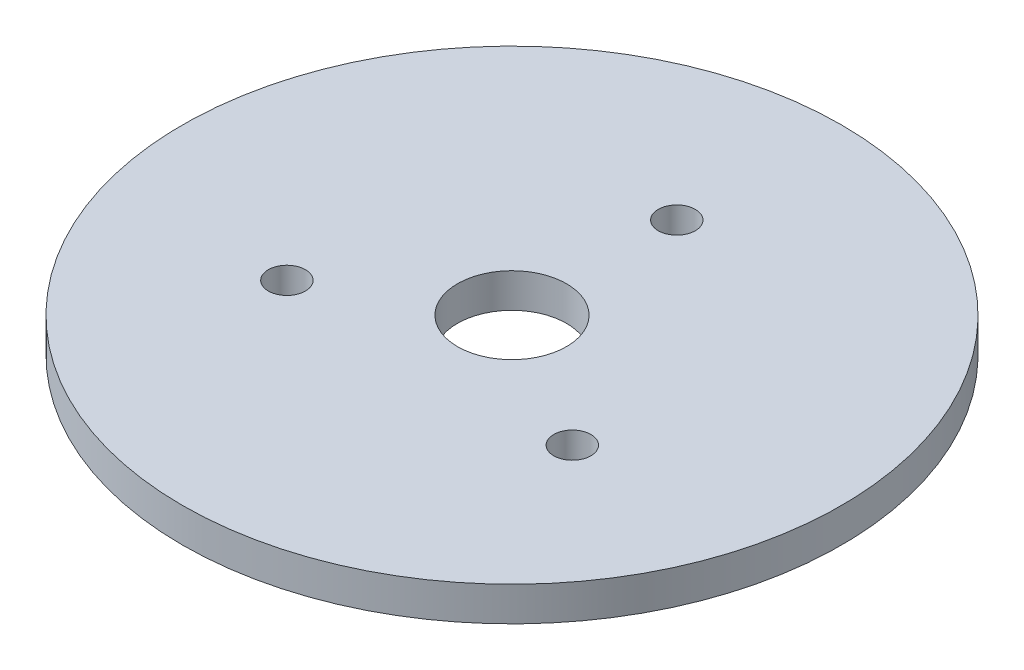
ISO-10303-21;
HEADER;
FILE_DESCRIPTION(('STEP AP214'),'2;1');
FILE_NAME('part.step','',(''),(''),'','','');
FILE_SCHEMA(('AUTOMOTIVE_DESIGN { 1 0 10303 214 1 1 1 1 }'));
ENDSEC;
DATA;
#1=APPLICATION_CONTEXT('core data for automotive mechanical design processes');
#2=APPLICATION_PROTOCOL_DEFINITION('international standard','automotive_design',2000,#1);
#3=PRODUCT_CONTEXT('',#1,'mechanical');
#4=PRODUCT('Part','Part','',(#3));
#5=PRODUCT_RELATED_PRODUCT_CATEGORY('part','',(#4));
#6=PRODUCT_DEFINITION_FORMATION('','',#4);
#7=PRODUCT_DEFINITION_CONTEXT('part definition',#1,'design');
#8=PRODUCT_DEFINITION('design','',#6,#7);
#9=PRODUCT_DEFINITION_SHAPE('','',#8);
#10=(LENGTH_UNIT() NAMED_UNIT(*) SI_UNIT(.MILLI.,.METRE.));
#11=(NAMED_UNIT(*) PLANE_ANGLE_UNIT() SI_UNIT($,.RADIAN.));
#12=(NAMED_UNIT(*) SI_UNIT($,.STERADIAN.) SOLID_ANGLE_UNIT());
#13=UNCERTAINTY_MEASURE_WITH_UNIT(LENGTH_MEASURE(1.E-05),#10,'distance_accuracy_value','');
#14=(GEOMETRIC_REPRESENTATION_CONTEXT(3) GLOBAL_UNCERTAINTY_ASSIGNED_CONTEXT((#13)) GLOBAL_UNIT_ASSIGNED_CONTEXT((#10,
#11,#12)) REPRESENTATION_CONTEXT('',''));
#15=CARTESIAN_POINT('',(0.,0.,0.));
#16=DIRECTION('',(0.,0.,1.));
#17=DIRECTION('',(1.,0.,0.));
#18=AXIS2_PLACEMENT_3D('',#15,#16,#17);
#19=CARTESIAN_POINT('',(0.,2.5,0.));
#20=DIRECTION('',(0.,1.,0.));
#21=DIRECTION('',(0.,0.,1.));
#22=AXIS2_PLACEMENT_3D('',#19,#20,#21);
#23=PLANE('',#22);
#24=CARTESIAN_POINT('',(0.,2.5,0.));
#25=DIRECTION('',(0.,1.,0.));
#26=DIRECTION('',(0.,0.,1.));
#27=AXIS2_PLACEMENT_3D('',#24,#25,#26);
#28=CIRCLE('',#27,3.96875);
#29=CARTESIAN_POINT('',(0.,2.5,3.96875));
#30=VERTEX_POINT('',#29);
#31=EDGE_CURVE('E65',#30,#30,#28,.T.);
#32=ORIENTED_EDGE('',*,*,#31,.F.);
#33=EDGE_LOOP('',(#32));
#34=FACE_BOUND('',#33,.T.);
#35=CARTESIAN_POINT('',(10.389135192436,2.5,5.99816999999967));
#36=DIRECTION('',(0.,1.,0.));
#37=DIRECTION('',(0.,0.,1.));
#38=AXIS2_PLACEMENT_3D('',#35,#36,#37);
#39=CIRCLE('',#38,1.35);
#40=CARTESIAN_POINT('',(10.389135192436,2.5,7.34816999999966));
#41=VERTEX_POINT('',#40);
#42=EDGE_CURVE('E50',#41,#41,#39,.T.);
#43=ORIENTED_EDGE('',*,*,#42,.F.);
#44=EDGE_LOOP('',(#43));
#45=FACE_BOUND('',#44,.T.);
#46=CARTESIAN_POINT('',(0.,2.5,0.));
#47=DIRECTION('',(0.,1.,0.));
#48=DIRECTION('',(0.,0.,1.));
#49=AXIS2_PLACEMENT_3D('',#46,#47,#48);
#50=CIRCLE('',#49,23.99268);
#51=CARTESIAN_POINT('',(0.,2.5,23.99268));
#52=VERTEX_POINT('',#51);
#53=EDGE_CURVE('E10',#52,#52,#50,.T.);
#54=ORIENTED_EDGE('',*,*,#53,.T.);
#55=EDGE_LOOP('',(#54));
#56=FACE_BOUND('',#55,.T.);
#57=CARTESIAN_POINT('',(0.,2.5,-11.99634));
#58=DIRECTION('',(0.,1.,0.));
#59=DIRECTION('',(0.,0.,1.));
#60=AXIS2_PLACEMENT_3D('',#57,#58,#59);
#61=CIRCLE('',#60,1.35);
#62=CARTESIAN_POINT('',(0.,2.5,-10.64634));
#63=VERTEX_POINT('',#62);
#64=EDGE_CURVE('E45',#63,#63,#61,.T.);
#65=ORIENTED_EDGE('',*,*,#64,.F.);
#66=EDGE_LOOP('',(#65));
#67=FACE_BOUND('',#66,.T.);
#68=CARTESIAN_POINT('',(-10.3891351924348,2.5,5.99817000000034));
#69=DIRECTION('',(0.,1.,0.));
#70=DIRECTION('',(0.,0.,1.));
#71=AXIS2_PLACEMENT_3D('',#68,#69,#70);
#72=CIRCLE('',#71,1.35);
#73=CARTESIAN_POINT('',(-10.3891351924348,2.5,7.34817000000034));
#74=VERTEX_POINT('',#73);
#75=EDGE_CURVE('E56',#74,#74,#72,.T.);
#76=ORIENTED_EDGE('',*,*,#75,.F.);
#77=EDGE_LOOP('',(#76));
#78=FACE_BOUND('',#77,.T.);
#79=ADVANCED_FACE('F34',(#34,#45,#56,#67,#78),#23,.T.);
#80=CARTESIAN_POINT('',(0.,0.,0.));
#81=DIRECTION('',(0.,1.,0.));
#82=DIRECTION('',(0.,0.,1.));
#83=AXIS2_PLACEMENT_3D('',#80,#81,#82);
#84=PLANE('',#83);
#85=CARTESIAN_POINT('',(0.,0.,0.));
#86=DIRECTION('',(0.,1.,0.));
#87=DIRECTION('',(0.,0.,1.));
#88=AXIS2_PLACEMENT_3D('',#85,#86,#87);
#89=CIRCLE('',#88,3.96875);
#90=CARTESIAN_POINT('',(0.,0.,3.96875));
#91=VERTEX_POINT('',#90);
#92=EDGE_CURVE('E62',#91,#91,#89,.T.);
#93=ORIENTED_EDGE('',*,*,#92,.T.);
#94=EDGE_LOOP('',(#93));
#95=FACE_BOUND('',#94,.T.);
#96=CARTESIAN_POINT('',(0.,0.,0.));
#97=DIRECTION('',(0.,1.,0.));
#98=DIRECTION('',(0.,0.,1.));
#99=AXIS2_PLACEMENT_3D('',#96,#97,#98);
#100=CIRCLE('',#99,23.99268);
#101=CARTESIAN_POINT('',(0.,0.,23.99268));
#102=VERTEX_POINT('',#101);
#103=EDGE_CURVE('E38',#102,#102,#100,.T.);
#104=ORIENTED_EDGE('',*,*,#103,.F.);
#105=EDGE_LOOP('',(#104));
#106=FACE_BOUND('',#105,.T.);
#107=CARTESIAN_POINT('',(0.,0.,-11.99634));
#108=DIRECTION('',(0.,1.,0.));
#109=DIRECTION('',(0.,0.,1.));
#110=AXIS2_PLACEMENT_3D('',#107,#108,#109);
#111=CIRCLE('',#110,1.35);
#112=CARTESIAN_POINT('',(0.,0.,-10.64634));
#113=VERTEX_POINT('',#112);
#114=EDGE_CURVE('E47',#113,#113,#111,.T.);
#115=ORIENTED_EDGE('',*,*,#114,.T.);
#116=EDGE_LOOP('',(#115));
#117=FACE_BOUND('',#116,.T.);
#118=CARTESIAN_POINT('',(10.389135192436,0.,5.99816999999967));
#119=DIRECTION('',(0.,1.,0.));
#120=DIRECTION('',(0.,0.,1.));
#121=AXIS2_PLACEMENT_3D('',#118,#119,#120);
#122=CIRCLE('',#121,1.35);
#123=CARTESIAN_POINT('',(10.389135192436,0.,7.34816999999966));
#124=VERTEX_POINT('',#123);
#125=EDGE_CURVE('E53',#124,#124,#122,.T.);
#126=ORIENTED_EDGE('',*,*,#125,.T.);
#127=EDGE_LOOP('',(#126));
#128=FACE_BOUND('',#127,.T.);
#129=CARTESIAN_POINT('',(-10.3891351924348,0.,5.99817000000034));
#130=DIRECTION('',(0.,1.,0.));
#131=DIRECTION('',(0.,0.,1.));
#132=AXIS2_PLACEMENT_3D('',#129,#130,#131);
#133=CIRCLE('',#132,1.35);
#134=CARTESIAN_POINT('',(-10.3891351924348,0.,7.34817000000034));
#135=VERTEX_POINT('',#134);
#136=EDGE_CURVE('E59',#135,#135,#133,.T.);
#137=ORIENTED_EDGE('',*,*,#136,.T.);
#138=EDGE_LOOP('',(#137));
#139=FACE_BOUND('',#138,.T.);
#140=ADVANCED_FACE('F71',(#95,#106,#117,#128,#139),#84,.F.);
#141=CARTESIAN_POINT('',(0.,2.5,0.));
#142=DIRECTION('',(0.,-1.,0.));
#143=DIRECTION('',(0.,0.,-1.));
#144=AXIS2_PLACEMENT_3D('',#141,#142,#143);
#145=CYLINDRICAL_SURFACE('',#144,23.99268);
#146=ORIENTED_EDGE('',*,*,#53,.F.);
#147=EDGE_LOOP('',(#146));
#148=FACE_BOUND('',#147,.T.);
#149=ORIENTED_EDGE('',*,*,#103,.T.);
#150=EDGE_LOOP('',(#149));
#151=FACE_BOUND('',#150,.T.);
#152=ADVANCED_FACE('F36',(#148,#151),#145,.T.);
#153=CARTESIAN_POINT('',(0.,2.5,-11.99634));
#154=DIRECTION('',(0.,-1.,0.));
#155=DIRECTION('',(0.,0.,-1.));
#156=AXIS2_PLACEMENT_3D('',#153,#154,#155);
#157=CYLINDRICAL_SURFACE('',#156,1.35);
#158=ORIENTED_EDGE('',*,*,#64,.T.);
#159=EDGE_LOOP('',(#158));
#160=FACE_BOUND('',#159,.T.);
#161=ORIENTED_EDGE('',*,*,#114,.F.);
#162=EDGE_LOOP('',(#161));
#163=FACE_BOUND('',#162,.T.);
#164=ADVANCED_FACE('F100',(#160,#163),#157,.F.);
#165=CARTESIAN_POINT('',(10.389135192436,2.5,5.99816999999967));
#166=DIRECTION('',(0.,-1.,0.));
#167=DIRECTION('',(0.,0.,-1.));
#168=AXIS2_PLACEMENT_3D('',#165,#166,#167);
#169=CYLINDRICAL_SURFACE('',#168,1.35);
#170=ORIENTED_EDGE('',*,*,#42,.T.);
#171=EDGE_LOOP('',(#170));
#172=FACE_BOUND('',#171,.T.);
#173=ORIENTED_EDGE('',*,*,#125,.F.);
#174=EDGE_LOOP('',(#173));
#175=FACE_BOUND('',#174,.T.);
#176=ADVANCED_FACE('F92',(#172,#175),#169,.F.);
#177=CARTESIAN_POINT('',(-10.3891351924348,2.5,5.99817000000034));
#178=DIRECTION('',(0.,-1.,0.));
#179=DIRECTION('',(0.,0.,-1.));
#180=AXIS2_PLACEMENT_3D('',#177,#178,#179);
#181=CYLINDRICAL_SURFACE('',#180,1.35);
#182=ORIENTED_EDGE('',*,*,#75,.T.);
#183=EDGE_LOOP('',(#182));
#184=FACE_BOUND('',#183,.T.);
#185=ORIENTED_EDGE('',*,*,#136,.F.);
#186=EDGE_LOOP('',(#185));
#187=FACE_BOUND('',#186,.T.);
#188=ADVANCED_FACE('F77',(#184,#187),#181,.F.);
#189=CARTESIAN_POINT('',(0.,0.,0.));
#190=DIRECTION('',(0.,1.,0.));
#191=DIRECTION('',(0.,0.,1.));
#192=AXIS2_PLACEMENT_3D('',#189,#190,#191);
#193=CYLINDRICAL_SURFACE('',#192,3.96875);
#194=ORIENTED_EDGE('',*,*,#92,.F.);
#195=EDGE_LOOP('',(#194));
#196=FACE_BOUND('',#195,.T.);
#197=ORIENTED_EDGE('',*,*,#31,.T.);
#198=EDGE_LOOP('',(#197));
#199=FACE_BOUND('',#198,.T.);
#200=ADVANCED_FACE('F74',(#196,#199),#193,.F.);
#201=CLOSED_SHELL('',(#79,#140,#152,#164,#176,#188,#200));
#202=MANIFOLD_SOLID_BREP('B2',#201);
#203=ADVANCED_BREP_SHAPE_REPRESENTATION('',(#18,#202),#14);
#204=SHAPE_DEFINITION_REPRESENTATION(#9,#203);
ENDSEC;
END-ISO-10303-21;
